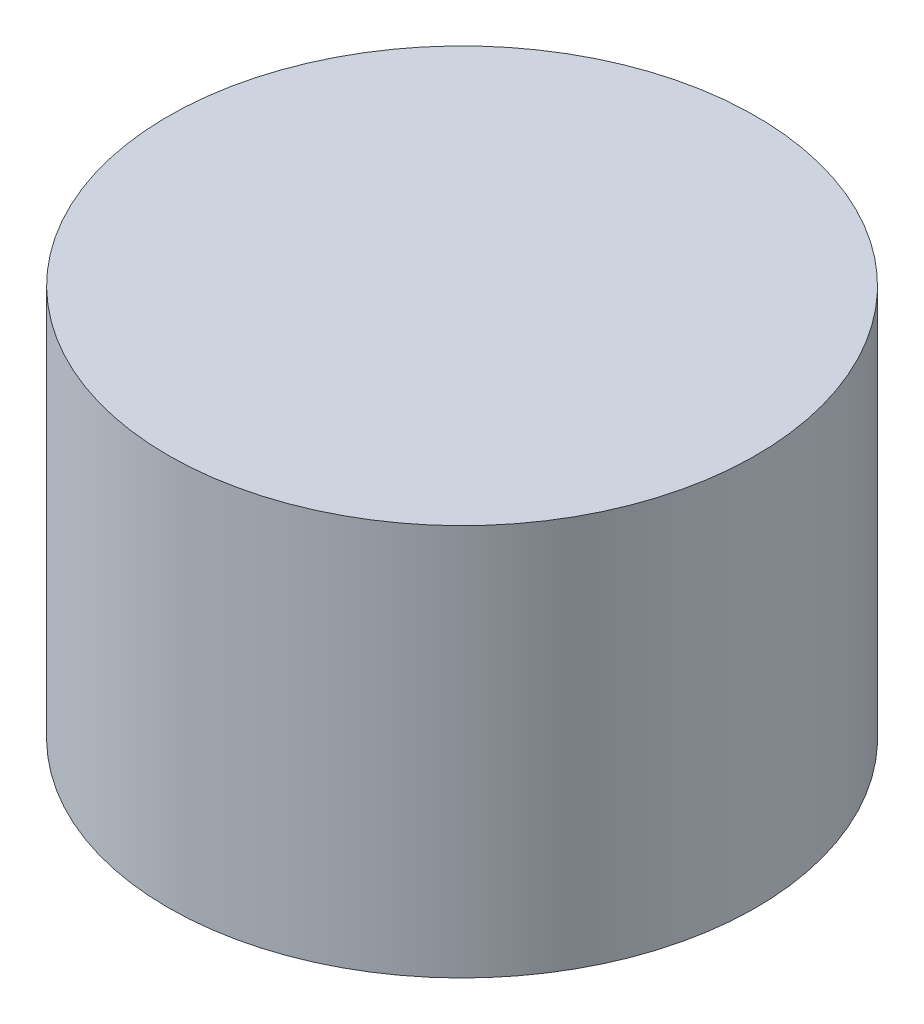
ISO-10303-21;
HEADER;
FILE_DESCRIPTION(('STEP AP214'),'2;1');
FILE_NAME('part.step','',(''),(''),'','','');
FILE_SCHEMA(('AUTOMOTIVE_DESIGN { 1 0 10303 214 1 1 1 1 }'));
ENDSEC;
DATA;
#1=APPLICATION_CONTEXT('core data for automotive mechanical design processes');
#2=APPLICATION_PROTOCOL_DEFINITION('international standard','automotive_design',2000,#1);
#3=PRODUCT_CONTEXT('',#1,'mechanical');
#4=PRODUCT('Part','Part','',(#3));
#5=PRODUCT_RELATED_PRODUCT_CATEGORY('part','',(#4));
#6=PRODUCT_DEFINITION_FORMATION('','',#4);
#7=PRODUCT_DEFINITION_CONTEXT('part definition',#1,'design');
#8=PRODUCT_DEFINITION('design','',#6,#7);
#9=PRODUCT_DEFINITION_SHAPE('','',#8);
#10=(LENGTH_UNIT() NAMED_UNIT(*) SI_UNIT(.MILLI.,.METRE.));
#11=(NAMED_UNIT(*) PLANE_ANGLE_UNIT() SI_UNIT($,.RADIAN.));
#12=(NAMED_UNIT(*) SI_UNIT($,.STERADIAN.) SOLID_ANGLE_UNIT());
#13=UNCERTAINTY_MEASURE_WITH_UNIT(LENGTH_MEASURE(1.E-05),#10,'distance_accuracy_value','');
#14=(GEOMETRIC_REPRESENTATION_CONTEXT(3) GLOBAL_UNCERTAINTY_ASSIGNED_CONTEXT((#13)) GLOBAL_UNIT_ASSIGNED_CONTEXT((#10,
#11,#12)) REPRESENTATION_CONTEXT('',''));
#15=CARTESIAN_POINT('',(0.,0.,0.));
#16=DIRECTION('',(0.,0.,1.));
#17=DIRECTION('',(1.,0.,0.));
#18=AXIS2_PLACEMENT_3D('',#15,#16,#17);
#19=CARTESIAN_POINT('',(0.,4.,0.));
#20=DIRECTION('',(0.,-1.,0.));
#21=DIRECTION('',(0.,0.,-1.));
#22=AXIS2_PLACEMENT_3D('',#19,#20,#21);
#23=CYLINDRICAL_SURFACE('',#22,3.);
#24=CARTESIAN_POINT('',(0.,4.,0.));
#25=DIRECTION('',(0.,1.,0.));
#26=DIRECTION('',(0.,0.,1.));
#27=AXIS2_PLACEMENT_3D('',#24,#25,#26);
#28=CIRCLE('',#27,3.);
#29=CARTESIAN_POINT('',(0.,4.,3.));
#30=VERTEX_POINT('',#29);
#31=EDGE_CURVE('E10',#30,#30,#28,.T.);
#32=ORIENTED_EDGE('',*,*,#31,.F.);
#33=EDGE_LOOP('',(#32));
#34=FACE_BOUND('',#33,.T.);
#35=CARTESIAN_POINT('',(0.,0.,0.));
#36=DIRECTION('',(0.,1.,0.));
#37=DIRECTION('',(0.,0.,1.));
#38=AXIS2_PLACEMENT_3D('',#35,#36,#37);
#39=CIRCLE('',#38,3.);
#40=CARTESIAN_POINT('',(0.,0.,3.));
#41=VERTEX_POINT('',#40);
#42=EDGE_CURVE('E35',#41,#41,#39,.T.);
#43=ORIENTED_EDGE('',*,*,#42,.T.);
#44=EDGE_LOOP('',(#43));
#45=FACE_BOUND('',#44,.T.);
#46=ADVANCED_FACE('F32',(#34,#45),#23,.T.);
#47=CARTESIAN_POINT('',(0.,4.,0.));
#48=DIRECTION('',(0.,1.,0.));
#49=DIRECTION('',(0.,0.,1.));
#50=AXIS2_PLACEMENT_3D('',#47,#48,#49);
#51=PLANE('',#50);
#52=ORIENTED_EDGE('',*,*,#31,.T.);
#53=EDGE_LOOP('',(#52));
#54=FACE_BOUND('',#53,.T.);
#55=ADVANCED_FACE('F47',(#54),#51,.T.);
#56=CARTESIAN_POINT('',(0.,0.,0.));
#57=DIRECTION('',(0.,1.,0.));
#58=DIRECTION('',(0.,0.,1.));
#59=AXIS2_PLACEMENT_3D('',#56,#57,#58);
#60=PLANE('',#59);
#61=ORIENTED_EDGE('',*,*,#42,.F.);
#62=EDGE_LOOP('',(#61));
#63=FACE_BOUND('',#62,.T.);
#64=ADVANCED_FACE('F45',(#63),#60,.F.);
#65=CLOSED_SHELL('',(#46,#55,#64));
#66=MANIFOLD_SOLID_BREP('B2',#65);
#67=ADVANCED_BREP_SHAPE_REPRESENTATION('',(#18,#66),#14);
#68=SHAPE_DEFINITION_REPRESENTATION(#9,#67);
ENDSEC;
END-ISO-10303-21;
